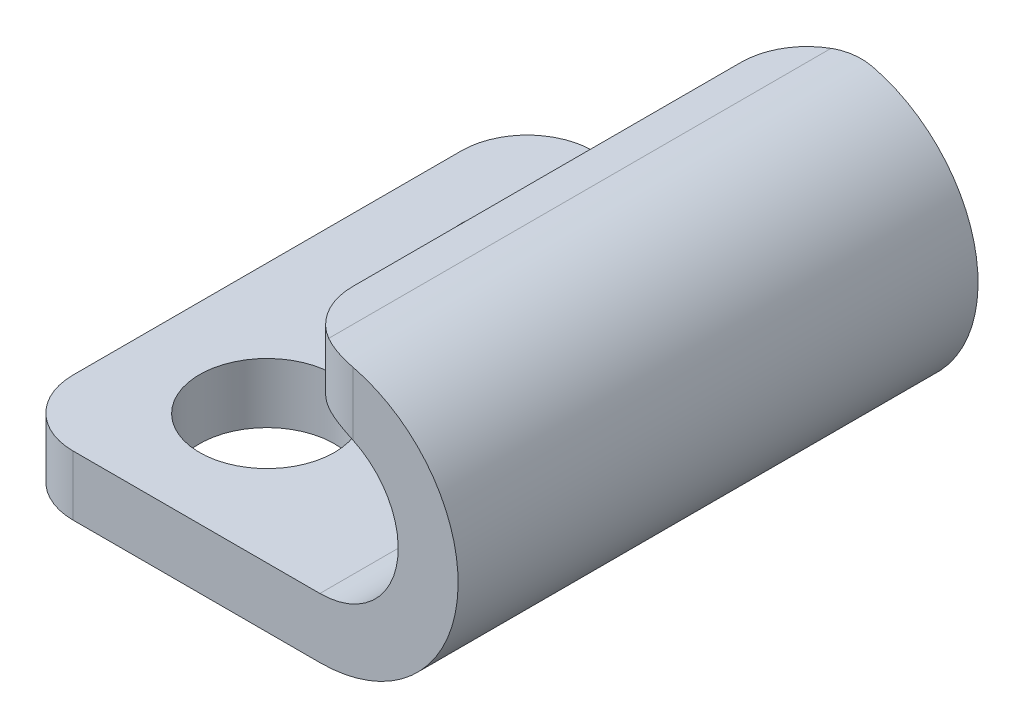
ISO-10303-21;
HEADER;
FILE_DESCRIPTION(('STEP AP214'),'2;1');
FILE_NAME('part.step','',(''),(''),'','','');
FILE_SCHEMA(('AUTOMOTIVE_DESIGN { 1 0 10303 214 1 1 1 1 }'));
ENDSEC;
DATA;
#1=APPLICATION_CONTEXT('core data for automotive mechanical design processes');
#2=APPLICATION_PROTOCOL_DEFINITION('international standard','automotive_design',2000,#1);
#3=PRODUCT_CONTEXT('',#1,'mechanical');
#4=PRODUCT('Part','Part','',(#3));
#5=PRODUCT_RELATED_PRODUCT_CATEGORY('part','',(#4));
#6=PRODUCT_DEFINITION_FORMATION('','',#4);
#7=PRODUCT_DEFINITION_CONTEXT('part definition',#1,'design');
#8=PRODUCT_DEFINITION('design','',#6,#7);
#9=PRODUCT_DEFINITION_SHAPE('','',#8);
#10=(LENGTH_UNIT() NAMED_UNIT(*) SI_UNIT(.MILLI.,.METRE.));
#11=(NAMED_UNIT(*) PLANE_ANGLE_UNIT() SI_UNIT($,.RADIAN.));
#12=(NAMED_UNIT(*) SI_UNIT($,.STERADIAN.) SOLID_ANGLE_UNIT());
#13=UNCERTAINTY_MEASURE_WITH_UNIT(LENGTH_MEASURE(1.E-05),#10,'distance_accuracy_value','');
#14=(GEOMETRIC_REPRESENTATION_CONTEXT(3) GLOBAL_UNCERTAINTY_ASSIGNED_CONTEXT((#13)) GLOBAL_UNIT_ASSIGNED_CONTEXT((#10,
#11,#12)) REPRESENTATION_CONTEXT('',''));
#15=CARTESIAN_POINT('',(0.,0.,0.));
#16=DIRECTION('',(0.,0.,1.));
#17=DIRECTION('',(1.,0.,0.));
#18=AXIS2_PLACEMENT_3D('',#15,#16,#17);
#19=CARTESIAN_POINT('',(-30.98252,-1.35000000000001,7.9));
#20=DIRECTION('',(0.,-1.,0.));
#21=DIRECTION('',(0.,0.,-1.));
#22=AXIS2_PLACEMENT_3D('',#19,#20,#21);
#23=PLANE('',#22);
#24=DIRECTION('',(0.,0.,-1.));
#25=VECTOR('',#24,1.);
#26=CARTESIAN_POINT('',(-30.98252,-1.35000000000001,7.9));
#27=LINE('',#26,#25);
#28=CARTESIAN_POINT('',(-30.98252,-1.35000000000001,7.63205080756888));
#29=VERTEX_POINT('',#28);
#30=CARTESIAN_POINT('',(-30.98252,-1.35000000000001,-7.63205080756888));
#31=VERTEX_POINT('',#30);
#32=EDGE_CURVE('E172',#29,#31,#27,.T.);
#33=ORIENTED_EDGE('',*,*,#32,.T.);
#34=CARTESIAN_POINT('',(-29.98252,-1.35000000000001,-5.9));
#35=DIRECTION('',(0.,-1.,0.));
#36=DIRECTION('',(0.,0.,-1.));
#37=AXIS2_PLACEMENT_3D('',#34,#35,#36);
#38=CIRCLE('',#37,2.);
#39=CARTESIAN_POINT('',(-31.98252,-1.35000000000001,-5.9));
#40=VERTEX_POINT('',#39);
#41=EDGE_CURVE('E282',#31,#40,#38,.F.);
#42=ORIENTED_EDGE('',*,*,#41,.T.);
#43=DIRECTION('',(0.,0.,-1.));
#44=VECTOR('',#43,1.);
#45=CARTESIAN_POINT('',(-31.98252,-1.35000000000001,7.9));
#46=LINE('',#45,#44);
#47=CARTESIAN_POINT('',(-31.98252,-1.35000000000001,5.9));
#48=VERTEX_POINT('',#47);
#49=EDGE_CURVE('E190',#48,#40,#46,.T.);
#50=ORIENTED_EDGE('',*,*,#49,.F.);
#51=CARTESIAN_POINT('',(-29.98252,-1.35000000000001,5.9));
#52=DIRECTION('',(0.,-1.,0.));
#53=DIRECTION('',(0.,0.,-1.));
#54=AXIS2_PLACEMENT_3D('',#51,#52,#53);
#55=CIRCLE('',#54,2.);
#56=EDGE_CURVE('E294',#48,#29,#55,.F.);
#57=ORIENTED_EDGE('',*,*,#56,.T.);
#58=EDGE_LOOP('',(#33,#42,#50,#57));
#59=FACE_BOUND('',#58,.T.);
#60=ADVANCED_FACE('F43',(#59),#23,.F.);
#61=CARTESIAN_POINT('',(-31.98252,-3.17000000000001,7.9));
#62=DIRECTION('',(-1.,0.,0.));
#63=DIRECTION('',(0.,0.,1.));
#64=AXIS2_PLACEMENT_3D('',#61,#62,#63);
#65=PLANE('',#64);
#66=ORIENTED_EDGE('',*,*,#49,.T.);
#67=DIRECTION('',(0.,1.,0.));
#68=VECTOR('',#67,1.);
#69=CARTESIAN_POINT('',(-31.98252,-3.17000000000001,-5.9));
#70=LINE('',#69,#68);
#71=CARTESIAN_POINT('',(-31.98252,-3.17000000000001,-5.9));
#72=VERTEX_POINT('',#71);
#73=EDGE_CURVE('E277',#40,#72,#70,.F.);
#74=ORIENTED_EDGE('',*,*,#73,.T.);
#75=DIRECTION('',(0.,0.,-1.));
#76=VECTOR('',#75,1.);
#77=CARTESIAN_POINT('',(-31.98252,-3.17000000000001,7.9));
#78=LINE('',#77,#76);
#79=CARTESIAN_POINT('',(-31.98252,-3.17000000000001,5.9));
#80=VERTEX_POINT('',#79);
#81=EDGE_CURVE('E187',#80,#72,#78,.T.);
#82=ORIENTED_EDGE('',*,*,#81,.F.);
#83=DIRECTION('',(0.,1.,0.));
#84=VECTOR('',#83,1.);
#85=CARTESIAN_POINT('',(-31.98252,-3.17000000000001,5.9));
#86=LINE('',#85,#84);
#87=EDGE_CURVE('E279',#80,#48,#86,.T.);
#88=ORIENTED_EDGE('',*,*,#87,.T.);
#89=EDGE_LOOP('',(#66,#74,#82,#88));
#90=FACE_BOUND('',#89,.T.);
#91=ADVANCED_FACE('F264',(#90),#65,.T.);
#92=CARTESIAN_POINT('',(-30.98252,-3.17000000000001,7.9));
#93=DIRECTION('',(0.,-1.,0.));
#94=DIRECTION('',(0.,0.,-1.));
#95=AXIS2_PLACEMENT_3D('',#92,#93,#94);
#96=PLANE('',#95);
#97=ORIENTED_EDGE('',*,*,#81,.T.);
#98=CARTESIAN_POINT('',(-29.98252,-3.17000000000001,-5.9));
#99=DIRECTION('',(0.,-1.,0.));
#100=DIRECTION('',(0.,0.,-1.));
#101=AXIS2_PLACEMENT_3D('',#98,#99,#100);
#102=CIRCLE('',#101,2.);
#103=CARTESIAN_POINT('',(-30.98252,-3.17000000000001,-7.63205080756888));
#104=VERTEX_POINT('',#103);
#105=EDGE_CURVE('E284',#72,#104,#102,.T.);
#106=ORIENTED_EDGE('',*,*,#105,.T.);
#107=DIRECTION('',(0.,0.,-1.));
#108=VECTOR('',#107,1.);
#109=CARTESIAN_POINT('',(-30.98252,-3.17000000000001,7.9));
#110=LINE('',#109,#108);
#111=CARTESIAN_POINT('',(-30.98252,-3.17000000000001,7.63205080756888));
#112=VERTEX_POINT('',#111);
#113=EDGE_CURVE('E153',#112,#104,#110,.T.);
#114=ORIENTED_EDGE('',*,*,#113,.F.);
#115=CARTESIAN_POINT('',(-29.98252,-3.17000000000001,5.9));
#116=DIRECTION('',(0.,-1.,0.));
#117=DIRECTION('',(0.,0.,-1.));
#118=AXIS2_PLACEMENT_3D('',#115,#116,#117);
#119=CIRCLE('',#118,2.);
#120=EDGE_CURVE('E285',#112,#80,#119,.T.);
#121=ORIENTED_EDGE('',*,*,#120,.T.);
#122=EDGE_LOOP('',(#97,#106,#114,#121));
#123=FACE_BOUND('',#122,.T.);
#124=ADVANCED_FACE('F238',(#123),#96,.T.);
#125=CARTESIAN_POINT('',(-30.98252,-5.55000000000001,7.9));
#126=DIRECTION('',(0.,0.,-1.));
#127=DIRECTION('',(-1.,0.,0.));
#128=AXIS2_PLACEMENT_3D('',#125,#126,#127);
#129=CYLINDRICAL_SURFACE('',#128,2.38);
#130=ORIENTED_EDGE('',*,*,#113,.T.);
#131=CARTESIAN_POINT('',(-30.98252,-3.17000000000001,-7.63205080756888));
#132=CARTESIAN_POINT('',(-30.9426669306957,-3.16999343315235,-7.65506948380878));
#133=CARTESIAN_POINT('',(-30.9020046744084,-3.17100102455965,-7.67670211676034));
#134=CARTESIAN_POINT('',(-30.8193694496314,-3.17523973256298,-7.71708285726754));
#135=CARTESIAN_POINT('',(-30.777396059928,-3.17847157087985,-7.73583002613471));
#136=CARTESIAN_POINT('',(-30.6936663983803,-3.18722936377501,-7.76982753921198));
#137=CARTESIAN_POINT('',(-30.6519372034802,-3.19268826094742,-7.78516138154765));
#138=CARTESIAN_POINT('',(-30.5679241062551,-3.20600248341835,-7.81292017081941));
#139=CARTESIAN_POINT('',(-30.5256403408429,-3.2138572275029,-7.8253458219696));
#140=CARTESIAN_POINT('',(-30.4000395941369,-3.24081923100761,-7.85781159907133));
#141=CARTESIAN_POINT('',(-30.3163254858499,-3.26348748819747,-7.87369960775026));
#142=CARTESIAN_POINT('',(-30.1910595535241,-3.30500118846406,-7.88956503716421));
#143=CARTESIAN_POINT('',(-30.1487628443779,-3.32036289374102,-7.89352199020609));
#144=CARTESIAN_POINT('',(-30.0649758700043,-3.35351647883537,-7.89873914280262));
#145=CARTESIAN_POINT('',(-30.0234853674976,-3.37130763086351,-7.90000014810496));
#146=CARTESIAN_POINT('',(-29.98252,-3.39027779564131,-7.9));
#147=B_SPLINE_CURVE_WITH_KNOTS('',3,(#131,#132,#133,#134,#135,#136,#137,#138,#139,#140,#141,
#142,#143,#144,#145,#146),.UNSPECIFIED.,.F.,.F.,(4,2,2,2,2,2,2,4),(0.,0.138041240318782,
0.27612729321493,0.410330849804974,0.544501875506439,0.807564048889559,0.942959108007657,
1.07831369545271),.UNSPECIFIED.);
#148=CARTESIAN_POINT('',(-29.98252,-3.39027779564131,-7.9));
#149=VERTEX_POINT('',#148);
#150=EDGE_CURVE('E249',#104,#149,#147,.T.);
#151=ORIENTED_EDGE('',*,*,#150,.T.);
#152=CARTESIAN_POINT('',(-30.98252,-5.55000000000001,-7.9));
#153=DIRECTION('',(0.,0.,1.));
#154=DIRECTION('',(1.,0.,0.));
#155=AXIS2_PLACEMENT_3D('',#152,#153,#154);
#156=CIRCLE('',#155,2.38);
#157=CARTESIAN_POINT('',(-30.98252,-7.93000000000001,-7.9));
#158=VERTEX_POINT('',#157);
#159=EDGE_CURVE('E152',#158,#149,#156,.T.);
#160=ORIENTED_EDGE('',*,*,#159,.F.);
#161=DIRECTION('',(0.,0.,-1.));
#162=VECTOR('',#161,1.);
#163=CARTESIAN_POINT('',(-30.98252,-7.93000000000001,7.9));
#164=LINE('',#163,#162);
#165=CARTESIAN_POINT('',(-30.98252,-7.93000000000001,7.9));
#166=VERTEX_POINT('',#165);
#167=EDGE_CURVE('E136',#166,#158,#164,.T.);
#168=ORIENTED_EDGE('',*,*,#167,.F.);
#169=CARTESIAN_POINT('',(-30.98252,-5.55000000000001,7.9));
#170=DIRECTION('',(0.,0.,1.));
#171=DIRECTION('',(1.,0.,0.));
#172=AXIS2_PLACEMENT_3D('',#169,#170,#171);
#173=CIRCLE('',#172,2.38);
#174=CARTESIAN_POINT('',(-29.98252,-3.39027779564131,7.9));
#175=VERTEX_POINT('',#174);
#176=EDGE_CURVE('E144',#166,#175,#173,.T.);
#177=ORIENTED_EDGE('',*,*,#176,.T.);
#178=CARTESIAN_POINT('',(-29.98252,-3.39027779564131,7.9));
#179=CARTESIAN_POINT('',(-30.0242785926862,-3.37093277790642,7.90000735673165));
#180=CARTESIAN_POINT('',(-30.0666133698909,-3.35281153856701,7.89869207114505));
#181=CARTESIAN_POINT('',(-30.1521157327664,-3.31909651986721,7.89325505238888));
#182=CARTESIAN_POINT('',(-30.1952835856389,-3.30350356703198,7.88913240374193));
#183=CARTESIAN_POINT('',(-30.2808846838588,-3.27533921839641,7.8780768690333));
#184=CARTESIAN_POINT('',(-30.3233044729154,-3.26269521271887,7.87122622929201));
#185=CARTESIAN_POINT('',(-30.4082271278321,-3.23990802098584,7.85464827503261));
#186=CARTESIAN_POINT('',(-30.4507299710851,-3.22976423003433,7.84492165757683));
#187=CARTESIAN_POINT('',(-30.5762746250154,-3.20339646272558,7.81175739532916));
#188=CARTESIAN_POINT('',(-30.6590355120587,-3.19069306409104,7.78412456683097));
#189=CARTESIAN_POINT('',(-30.7815080336266,-3.17813103629819,7.73402748263121));
#190=CARTESIAN_POINT('',(-30.8226196425455,-3.17503069104559,7.7155630727761));
#191=CARTESIAN_POINT('',(-30.903576910257,-3.17096533199202,7.67586110139069));
#192=CARTESIAN_POINT('',(-30.9434229402661,-3.16999968623725,7.65462436254944));
#193=CARTESIAN_POINT('',(-30.98252,-3.17000000000001,7.63205080756888));
#194=B_SPLINE_CURVE_WITH_KNOTS('',3,(#178,#179,#180,#181,#182,#183,#184,#185,#186,#187,#188,
#189,#190,#191,#192,#193),.UNSPECIFIED.,.F.,.F.,(4,2,2,2,2,2,2,4),(0.,0.138038954123492,
0.276122944136763,0.410325713446665,0.544495982115865,0.807560184805469,0.942957161211712,
1.07831404949273),.UNSPECIFIED.);
#195=EDGE_CURVE('E242',#175,#112,#194,.T.);
#196=ORIENTED_EDGE('',*,*,#195,.T.);
#197=EDGE_LOOP('',(#130,#151,#160,#168,#177,#196));
#198=FACE_BOUND('',#197,.T.);
#199=ADVANCED_FACE('F149',(#198),#129,.F.);
#200=CARTESIAN_POINT('',(-40.48252,-7.93000000000001,7.9));
#201=DIRECTION('',(0.,1.,0.));
#202=DIRECTION('',(-1.,0.,0.));
#203=AXIS2_PLACEMENT_3D('',#200,#201,#202);
#204=PLANE('',#203);
#205=CARTESIAN_POINT('',(-36.52252,-7.93000000000001,-3.96875));
#206=DIRECTION('',(0.,1.,0.));
#207=DIRECTION('',(-1.,0.,0.));
#208=AXIS2_PLACEMENT_3D('',#205,#206,#207);
#209=CIRCLE('',#208,2.05);
#210=CARTESIAN_POINT('',(-38.57252,-7.93000000000001,-3.96875));
#211=VERTEX_POINT('',#210);
#212=EDGE_CURVE('E414',#211,#211,#209,.T.);
#213=ORIENTED_EDGE('',*,*,#212,.F.);
#214=EDGE_LOOP('',(#213));
#215=FACE_BOUND('',#214,.T.);
#216=CARTESIAN_POINT('',(-36.52252,-7.93000000000001,3.96875));
#217=DIRECTION('',(0.,1.,0.));
#218=DIRECTION('',(1.,0.,0.));
#219=AXIS2_PLACEMENT_3D('',#216,#217,#218);
#220=CIRCLE('',#219,2.05);
#221=CARTESIAN_POINT('',(-34.47252,-7.93000000000001,3.96875));
#222=VERTEX_POINT('',#221);
#223=EDGE_CURVE('E166',#222,#222,#220,.T.);
#224=ORIENTED_EDGE('',*,*,#223,.F.);
#225=EDGE_LOOP('',(#224));
#226=FACE_BOUND('',#225,.T.);
#227=DIRECTION('',(1.,0.,0.));
#228=VECTOR('',#227,1.);
#229=CARTESIAN_POINT('',(-40.48252,-7.93000000000001,-7.9));
#230=LINE('',#229,#228);
#231=CARTESIAN_POINT('',(-38.48252,-7.93000000000001,-7.9));
#232=VERTEX_POINT('',#231);
#233=EDGE_CURVE('E174',#232,#158,#230,.T.);
#234=ORIENTED_EDGE('',*,*,#233,.F.);
#235=CARTESIAN_POINT('',(-38.48252,-7.93000000000001,-5.9));
#236=DIRECTION('',(0.,1.,0.));
#237=DIRECTION('',(-1.,0.,0.));
#238=AXIS2_PLACEMENT_3D('',#235,#236,#237);
#239=CIRCLE('',#238,2.);
#240=CARTESIAN_POINT('',(-40.48252,-7.93000000000001,-5.9));
#241=VERTEX_POINT('',#240);
#242=EDGE_CURVE('E301',#232,#241,#239,.T.);
#243=ORIENTED_EDGE('',*,*,#242,.T.);
#244=DIRECTION('',(0.,0.,-1.));
#245=VECTOR('',#244,1.);
#246=CARTESIAN_POINT('',(-40.48252,-7.93000000000001,7.9));
#247=LINE('',#246,#245);
#248=CARTESIAN_POINT('',(-40.48252,-7.93000000000001,5.9));
#249=VERTEX_POINT('',#248);
#250=EDGE_CURVE('E154',#249,#241,#247,.T.);
#251=ORIENTED_EDGE('',*,*,#250,.F.);
#252=CARTESIAN_POINT('',(-38.48252,-7.93000000000001,5.9));
#253=DIRECTION('',(0.,1.,0.));
#254=DIRECTION('',(-1.,0.,0.));
#255=AXIS2_PLACEMENT_3D('',#252,#253,#254);
#256=CIRCLE('',#255,2.);
#257=CARTESIAN_POINT('',(-38.48252,-7.93000000000001,7.9));
#258=VERTEX_POINT('',#257);
#259=EDGE_CURVE('E139',#249,#258,#256,.T.);
#260=ORIENTED_EDGE('',*,*,#259,.T.);
#261=DIRECTION('',(1.,0.,0.));
#262=VECTOR('',#261,1.);
#263=CARTESIAN_POINT('',(-40.48252,-7.93000000000001,7.9));
#264=LINE('',#263,#262);
#265=EDGE_CURVE('E132',#258,#166,#264,.T.);
#266=ORIENTED_EDGE('',*,*,#265,.T.);
#267=ORIENTED_EDGE('',*,*,#167,.T.);
#268=EDGE_LOOP('',(#234,#243,#251,#260,#266,#267));
#269=FACE_BOUND('',#268,.T.);
#270=ADVANCED_FACE('F135',(#215,#226,#269),#204,.T.);
#271=CARTESIAN_POINT('',(-40.48252,-9.75000000000001,7.9));
#272=DIRECTION('',(-1.,0.,0.));
#273=DIRECTION('',(0.,0.,1.));
#274=AXIS2_PLACEMENT_3D('',#271,#272,#273);
#275=PLANE('',#274);
#276=ORIENTED_EDGE('',*,*,#250,.T.);
#277=DIRECTION('',(0.,1.,0.));
#278=VECTOR('',#277,1.);
#279=CARTESIAN_POINT('',(-40.48252,-9.75000000000001,-5.9));
#280=LINE('',#279,#278);
#281=CARTESIAN_POINT('',(-40.48252,-9.75000000000001,-5.9));
#282=VERTEX_POINT('',#281);
#283=EDGE_CURVE('E58',#241,#282,#280,.F.);
#284=ORIENTED_EDGE('',*,*,#283,.T.);
#285=DIRECTION('',(0.,0.,-1.));
#286=VECTOR('',#285,1.);
#287=CARTESIAN_POINT('',(-40.48252,-9.75000000000001,7.9));
#288=LINE('',#287,#286);
#289=CARTESIAN_POINT('',(-40.48252,-9.75000000000001,5.9));
#290=VERTEX_POINT('',#289);
#291=EDGE_CURVE('E183',#290,#282,#288,.T.);
#292=ORIENTED_EDGE('',*,*,#291,.F.);
#293=DIRECTION('',(0.,1.,0.));
#294=VECTOR('',#293,1.);
#295=CARTESIAN_POINT('',(-40.48252,-9.75000000000001,5.9));
#296=LINE('',#295,#294);
#297=EDGE_CURVE('E303',#290,#249,#296,.T.);
#298=ORIENTED_EDGE('',*,*,#297,.T.);
#299=EDGE_LOOP('',(#276,#284,#292,#298));
#300=FACE_BOUND('',#299,.T.);
#301=ADVANCED_FACE('F228',(#300),#275,.T.);
#302=CARTESIAN_POINT('',(-40.48252,-9.75000000000001,7.9));
#303=DIRECTION('',(0.,1.,0.));
#304=DIRECTION('',(-1.,0.,0.));
#305=AXIS2_PLACEMENT_3D('',#302,#303,#304);
#306=PLANE('',#305);
#307=CARTESIAN_POINT('',(-36.52252,-9.75000000000003,-3.96875));
#308=DIRECTION('',(0.,1.,0.));
#309=DIRECTION('',(-1.,0.,0.));
#310=AXIS2_PLACEMENT_3D('',#307,#308,#309);
#311=CIRCLE('',#310,2.05);
#312=CARTESIAN_POINT('',(-38.57252,-9.75000000000003,-3.96875));
#313=VERTEX_POINT('',#312);
#314=EDGE_CURVE('E175',#313,#313,#311,.T.);
#315=ORIENTED_EDGE('',*,*,#314,.T.);
#316=EDGE_LOOP('',(#315));
#317=FACE_BOUND('',#316,.T.);
#318=CARTESIAN_POINT('',(-36.52252,-9.75000000000003,3.96875));
#319=DIRECTION('',(0.,1.,0.));
#320=DIRECTION('',(1.,0.,0.));
#321=AXIS2_PLACEMENT_3D('',#318,#319,#320);
#322=CIRCLE('',#321,2.05);
#323=CARTESIAN_POINT('',(-34.47252,-9.75000000000003,3.96875));
#324=VERTEX_POINT('',#323);
#325=EDGE_CURVE('E415',#324,#324,#322,.T.);
#326=ORIENTED_EDGE('',*,*,#325,.T.);
#327=EDGE_LOOP('',(#326));
#328=FACE_BOUND('',#327,.T.);
#329=ORIENTED_EDGE('',*,*,#291,.T.);
#330=CARTESIAN_POINT('',(-38.48252,-9.75000000000001,-5.9));
#331=DIRECTION('',(0.,1.,0.));
#332=DIRECTION('',(-1.,0.,0.));
#333=AXIS2_PLACEMENT_3D('',#330,#331,#332);
#334=CIRCLE('',#333,2.);
#335=CARTESIAN_POINT('',(-38.48252,-9.75000000000001,-7.9));
#336=VERTEX_POINT('',#335);
#337=EDGE_CURVE('E11',#282,#336,#334,.F.);
#338=ORIENTED_EDGE('',*,*,#337,.T.);
#339=DIRECTION('',(1.,0.,0.));
#340=VECTOR('',#339,1.);
#341=CARTESIAN_POINT('',(-40.48252,-9.75000000000001,-7.9));
#342=LINE('',#341,#340);
#343=CARTESIAN_POINT('',(-30.98252,-9.75000000000001,-7.9));
#344=VERTEX_POINT('',#343);
#345=EDGE_CURVE('E163',#336,#344,#342,.T.);
#346=ORIENTED_EDGE('',*,*,#345,.T.);
#347=DIRECTION('',(0.,0.,-1.));
#348=VECTOR('',#347,1.);
#349=CARTESIAN_POINT('',(-30.98252,-9.75000000000001,7.9));
#350=LINE('',#349,#348);
#351=CARTESIAN_POINT('',(-30.98252,-9.75000000000001,7.9));
#352=VERTEX_POINT('',#351);
#353=EDGE_CURVE('E180',#352,#344,#350,.T.);
#354=ORIENTED_EDGE('',*,*,#353,.F.);
#355=DIRECTION('',(1.,0.,0.));
#356=VECTOR('',#355,1.);
#357=CARTESIAN_POINT('',(-40.48252,-9.75000000000001,7.9));
#358=LINE('',#357,#356);
#359=CARTESIAN_POINT('',(-38.48252,-9.75000000000001,7.9));
#360=VERTEX_POINT('',#359);
#361=EDGE_CURVE('E143',#360,#352,#358,.T.);
#362=ORIENTED_EDGE('',*,*,#361,.F.);
#363=CARTESIAN_POINT('',(-38.48252,-9.75000000000001,5.9));
#364=DIRECTION('',(0.,1.,0.));
#365=DIRECTION('',(-1.,0.,0.));
#366=AXIS2_PLACEMENT_3D('',#363,#364,#365);
#367=CIRCLE('',#366,2.);
#368=EDGE_CURVE('E51',#360,#290,#367,.F.);
#369=ORIENTED_EDGE('',*,*,#368,.T.);
#370=EDGE_LOOP('',(#329,#338,#346,#354,#362,#369));
#371=FACE_BOUND('',#370,.T.);
#372=ADVANCED_FACE('F221',(#317,#328,#371),#306,.F.);
#373=CARTESIAN_POINT('',(-30.98252,-5.55000000000001,7.9));
#374=DIRECTION('',(0.,0.,-1.));
#375=DIRECTION('',(-1.,0.,0.));
#376=AXIS2_PLACEMENT_3D('',#373,#374,#375);
#377=CYLINDRICAL_SURFACE('',#376,4.2);
#378=CARTESIAN_POINT('',(-30.98252,-5.55000000000001,-7.9));
#379=DIRECTION('',(0.,0.,1.));
#380=DIRECTION('',(1.,0.,0.));
#381=AXIS2_PLACEMENT_3D('',#378,#379,#380);
#382=CIRCLE('',#381,4.2);
#383=CARTESIAN_POINT('',(-29.98252,-1.47078438912578,-7.9));
#384=VERTEX_POINT('',#383);
#385=EDGE_CURVE('E160',#344,#384,#382,.T.);
#386=ORIENTED_EDGE('',*,*,#385,.T.);
#387=CARTESIAN_POINT('',(-29.98252,-1.47078438912578,-7.9));
#388=CARTESIAN_POINT('',(-30.0335756318918,-1.45825929253699,-7.90000817503138));
#389=CARTESIAN_POINT('',(-30.0848756049755,-1.44670835294333,-7.89804508907814));
#390=CARTESIAN_POINT('',(-30.1875884359862,-1.42558318040621,-7.89012372068189));
#391=CARTESIAN_POINT('',(-30.2390013216728,-1.4160095059472,-7.88416431147849));
#392=CARTESIAN_POINT('',(-30.3403185802096,-1.39907763220441,-7.86838697270779));
#393=CARTESIAN_POINT('',(-30.3902298025153,-1.39167225776051,-7.85866394517383));
#394=CARTESIAN_POINT('',(-30.4893746756415,-1.37875213921608,-7.83537917402472));
#395=CARTESIAN_POINT('',(-30.538608552957,-1.37323674761802,-7.82181874799358));
#396=CARTESIAN_POINT('',(-30.655304363299,-1.36221148883735,-7.7847902737051));
#397=CARTESIAN_POINT('',(-30.7222853991167,-1.35756418729505,-7.75952445146309));
#398=CARTESIAN_POINT('',(-30.8543994964624,-1.35141778320469,-7.70143217523676));
#399=CARTESIAN_POINT('',(-30.9194820094497,-1.3499733630073,-7.66848485750113));
#400=CARTESIAN_POINT('',(-30.98252,-1.35000000000001,-7.63205080756888));
#401=B_SPLINE_CURVE_WITH_KNOTS('',3,(#387,#388,#389,#390,#391,#392,#393,#394,#395,#396,#397,
#398,#399,#400),.UNSPECIFIED.,.F.,.F.,(4,2,2,2,2,2,4),(0.,0.157670154354608,0.315384782394502,
0.469357469733874,0.623277354031808,0.837990106963582,1.05634127953329),.UNSPECIFIED.);
#402=EDGE_CURVE('E207',#384,#31,#401,.T.);
#403=ORIENTED_EDGE('',*,*,#402,.T.);
#404=ORIENTED_EDGE('',*,*,#32,.F.);
#405=CARTESIAN_POINT('',(-30.98252,-1.35000000000001,7.63205080756888));
#406=CARTESIAN_POINT('',(-30.9369965723697,-1.34999381743161,7.65834286753092));
#407=CARTESIAN_POINT('',(-30.8904253127812,-1.35073993191962,7.68282856770708));
#408=CARTESIAN_POINT('',(-30.7955343226552,-1.35389741090192,7.72804883312103));
#409=CARTESIAN_POINT('',(-30.7472140882726,-1.35630925893795,7.74878230692799));
#410=CARTESIAN_POINT('',(-30.650362673347,-1.36288011537155,7.78589839069428));
#411=CARTESIAN_POINT('',(-30.6018637351383,-1.36699628556606,7.80237260743479));
#412=CARTESIAN_POINT('',(-30.5039431285734,-1.37706460412387,7.83150936278292));
#413=CARTESIAN_POINT('',(-30.4545217867278,-1.38301611397748,7.84417322398044));
#414=CARTESIAN_POINT('',(-30.3354602420349,-1.39955533268615,7.86988699896127));
#415=CARTESIAN_POINT('',(-30.2655438372609,-1.41104575830706,7.88111389079534));
#416=CARTESIAN_POINT('',(-30.124427571591,-1.43794442684826,7.89625156445124));
#417=CARTESIAN_POINT('',(-30.0532260381396,-1.45341575887601,7.90003514905295));
#418=CARTESIAN_POINT('',(-29.98252,-1.47078438912578,7.9));
#419=B_SPLINE_CURVE_WITH_KNOTS('',3,(#405,#406,#407,#408,#409,#410,#411,#412,#413,#414,#415,
#416,#417,#418),.UNSPECIFIED.,.F.,.F.,(4,2,2,2,2,2,4),(0.,0.157671228564333,0.315388246374414,
0.469360949639329,0.623280146534017,0.837991565399337,1.05634132852604),.UNSPECIFIED.);
#420=CARTESIAN_POINT('',(-29.98252,-1.47078438912578,7.9));
#421=VERTEX_POINT('',#420);
#422=EDGE_CURVE('E199',#29,#421,#419,.T.);
#423=ORIENTED_EDGE('',*,*,#422,.T.);
#424=CARTESIAN_POINT('',(-30.98252,-5.55000000000001,7.9));
#425=DIRECTION('',(0.,0.,1.));
#426=DIRECTION('',(1.,0.,0.));
#427=AXIS2_PLACEMENT_3D('',#424,#425,#426);
#428=CIRCLE('',#427,4.2);
#429=EDGE_CURVE('E170',#352,#421,#428,.T.);
#430=ORIENTED_EDGE('',*,*,#429,.F.);
#431=ORIENTED_EDGE('',*,*,#353,.T.);
#432=EDGE_LOOP('',(#386,#403,#404,#423,#430,#431));
#433=FACE_BOUND('',#432,.T.);
#434=ADVANCED_FACE('F216',(#433),#377,.T.);
#435=CARTESIAN_POINT('',(-30.98252,-5.55000000000001,7.9));
#436=DIRECTION('',(0.,0.,1.));
#437=DIRECTION('',(1.,0.,0.));
#438=AXIS2_PLACEMENT_3D('',#435,#436,#437);
#439=PLANE('',#438);
#440=ORIENTED_EDGE('',*,*,#429,.T.);
#441=DIRECTION('',(0.,1.,0.));
#442=VECTOR('',#441,1.);
#443=CARTESIAN_POINT('',(-29.98252,-5.55000000000001,7.9));
#444=LINE('',#443,#442);
#445=EDGE_CURVE('E159',#421,#175,#444,.F.);
#446=ORIENTED_EDGE('',*,*,#445,.T.);
#447=ORIENTED_EDGE('',*,*,#176,.F.);
#448=ORIENTED_EDGE('',*,*,#265,.F.);
#449=DIRECTION('',(0.,1.,0.));
#450=VECTOR('',#449,1.);
#451=CARTESIAN_POINT('',(-38.48252,-5.55000000000001,7.9));
#452=LINE('',#451,#450);
#453=EDGE_CURVE('E255',#258,#360,#452,.F.);
#454=ORIENTED_EDGE('',*,*,#453,.T.);
#455=ORIENTED_EDGE('',*,*,#361,.T.);
#456=EDGE_LOOP('',(#440,#446,#447,#448,#454,#455));
#457=FACE_BOUND('',#456,.T.);
#458=ADVANCED_FACE('F157',(#457),#439,.T.);
#459=CARTESIAN_POINT('',(-30.98252,-5.55000000000001,-7.9));
#460=DIRECTION('',(0.,0.,1.));
#461=DIRECTION('',(1.,0.,0.));
#462=AXIS2_PLACEMENT_3D('',#459,#460,#461);
#463=PLANE('',#462);
#464=ORIENTED_EDGE('',*,*,#159,.T.);
#465=DIRECTION('',(0.,1.,0.));
#466=VECTOR('',#465,1.);
#467=CARTESIAN_POINT('',(-29.98252,-1.35000000000001,-7.9));
#468=LINE('',#467,#466);
#469=EDGE_CURVE('E196',#149,#384,#468,.T.);
#470=ORIENTED_EDGE('',*,*,#469,.T.);
#471=ORIENTED_EDGE('',*,*,#385,.F.);
#472=ORIENTED_EDGE('',*,*,#345,.F.);
#473=DIRECTION('',(0.,1.,0.));
#474=VECTOR('',#473,1.);
#475=CARTESIAN_POINT('',(-38.48252,-7.93000000000001,-7.9));
#476=LINE('',#475,#474);
#477=EDGE_CURVE('E193',#336,#232,#476,.T.);
#478=ORIENTED_EDGE('',*,*,#477,.T.);
#479=ORIENTED_EDGE('',*,*,#233,.T.);
#480=EDGE_LOOP('',(#464,#470,#471,#472,#478,#479));
#481=FACE_BOUND('',#480,.T.);
#482=ADVANCED_FACE('F223',(#481),#463,.F.);
#483=CARTESIAN_POINT('',(-29.98252,-5.55000000000001,-5.9));
#484=DIRECTION('',(0.,-1.,0.));
#485=DIRECTION('',(0.,0.,-1.));
#486=AXIS2_PLACEMENT_3D('',#483,#484,#485);
#487=CYLINDRICAL_SURFACE('',#486,2.);
#488=ORIENTED_EDGE('',*,*,#105,.F.);
#489=ORIENTED_EDGE('',*,*,#73,.F.);
#490=ORIENTED_EDGE('',*,*,#41,.F.);
#491=ORIENTED_EDGE('',*,*,#402,.F.);
#492=ORIENTED_EDGE('',*,*,#469,.F.);
#493=ORIENTED_EDGE('',*,*,#150,.F.);
#494=EDGE_LOOP('',(#488,#489,#490,#491,#492,#493));
#495=FACE_BOUND('',#494,.T.);
#496=ADVANCED_FACE('F257',(#495),#487,.T.);
#497=CARTESIAN_POINT('',(-29.98252,-3.17000000000001,5.9));
#498=DIRECTION('',(0.,1.,0.));
#499=DIRECTION('',(0.,0.,1.));
#500=AXIS2_PLACEMENT_3D('',#497,#498,#499);
#501=CYLINDRICAL_SURFACE('',#500,2.);
#502=ORIENTED_EDGE('',*,*,#195,.F.);
#503=ORIENTED_EDGE('',*,*,#445,.F.);
#504=ORIENTED_EDGE('',*,*,#422,.F.);
#505=ORIENTED_EDGE('',*,*,#56,.F.);
#506=ORIENTED_EDGE('',*,*,#87,.F.);
#507=ORIENTED_EDGE('',*,*,#120,.F.);
#508=EDGE_LOOP('',(#502,#503,#504,#505,#506,#507));
#509=FACE_BOUND('',#508,.T.);
#510=ADVANCED_FACE('F214',(#509),#501,.T.);
#511=CARTESIAN_POINT('',(-38.48252,-5.55000000000001,-5.9));
#512=DIRECTION('',(0.,-1.,0.));
#513=DIRECTION('',(0.,0.,-1.));
#514=AXIS2_PLACEMENT_3D('',#511,#512,#513);
#515=CYLINDRICAL_SURFACE('',#514,2.);
#516=ORIENTED_EDGE('',*,*,#337,.F.);
#517=ORIENTED_EDGE('',*,*,#283,.F.);
#518=ORIENTED_EDGE('',*,*,#242,.F.);
#519=ORIENTED_EDGE('',*,*,#477,.F.);
#520=EDGE_LOOP('',(#516,#517,#518,#519));
#521=FACE_BOUND('',#520,.T.);
#522=ADVANCED_FACE('F308',(#521),#515,.T.);
#523=CARTESIAN_POINT('',(-38.48252,-9.75000000000001,5.9));
#524=DIRECTION('',(0.,1.,0.));
#525=DIRECTION('',(0.,0.,1.));
#526=AXIS2_PLACEMENT_3D('',#523,#524,#525);
#527=CYLINDRICAL_SURFACE('',#526,2.);
#528=ORIENTED_EDGE('',*,*,#368,.F.);
#529=ORIENTED_EDGE('',*,*,#453,.F.);
#530=ORIENTED_EDGE('',*,*,#259,.F.);
#531=ORIENTED_EDGE('',*,*,#297,.F.);
#532=EDGE_LOOP('',(#528,#529,#530,#531));
#533=FACE_BOUND('',#532,.T.);
#534=ADVANCED_FACE('F45',(#533),#527,.T.);
#535=CARTESIAN_POINT('',(-36.52252,-9.75000000000003,3.96875));
#536=DIRECTION('',(0.,1.,0.));
#537=DIRECTION('',(-1.,0.,0.));
#538=AXIS2_PLACEMENT_3D('',#535,#536,#537);
#539=CYLINDRICAL_SURFACE('',#538,2.05);
#540=ORIENTED_EDGE('',*,*,#325,.F.);
#541=EDGE_LOOP('',(#540));
#542=FACE_BOUND('',#541,.T.);
#543=ORIENTED_EDGE('',*,*,#223,.T.);
#544=EDGE_LOOP('',(#543));
#545=FACE_BOUND('',#544,.T.);
#546=ADVANCED_FACE('F316',(#542,#545),#539,.F.);
#547=CARTESIAN_POINT('',(-36.52252,-9.75000000000003,-3.96875));
#548=DIRECTION('',(0.,1.,0.));
#549=DIRECTION('',(-1.,0.,0.));
#550=AXIS2_PLACEMENT_3D('',#547,#548,#549);
#551=CYLINDRICAL_SURFACE('',#550,2.05);
#552=ORIENTED_EDGE('',*,*,#314,.F.);
#553=EDGE_LOOP('',(#552));
#554=FACE_BOUND('',#553,.T.);
#555=ORIENTED_EDGE('',*,*,#212,.T.);
#556=EDGE_LOOP('',(#555));
#557=FACE_BOUND('',#556,.T.);
#558=ADVANCED_FACE('F322',(#554,#557),#551,.F.);
#559=CLOSED_SHELL('',(#60,#91,#124,#199,#270,#301,#372,#434,#458,#482,#496,#510,#522,#534,#546,#558));
#560=MANIFOLD_SOLID_BREP('B2',#559);
#561=ADVANCED_BREP_SHAPE_REPRESENTATION('',(#18,#560),#14);
#562=SHAPE_DEFINITION_REPRESENTATION(#9,#561);
ENDSEC;
END-ISO-10303-21;
